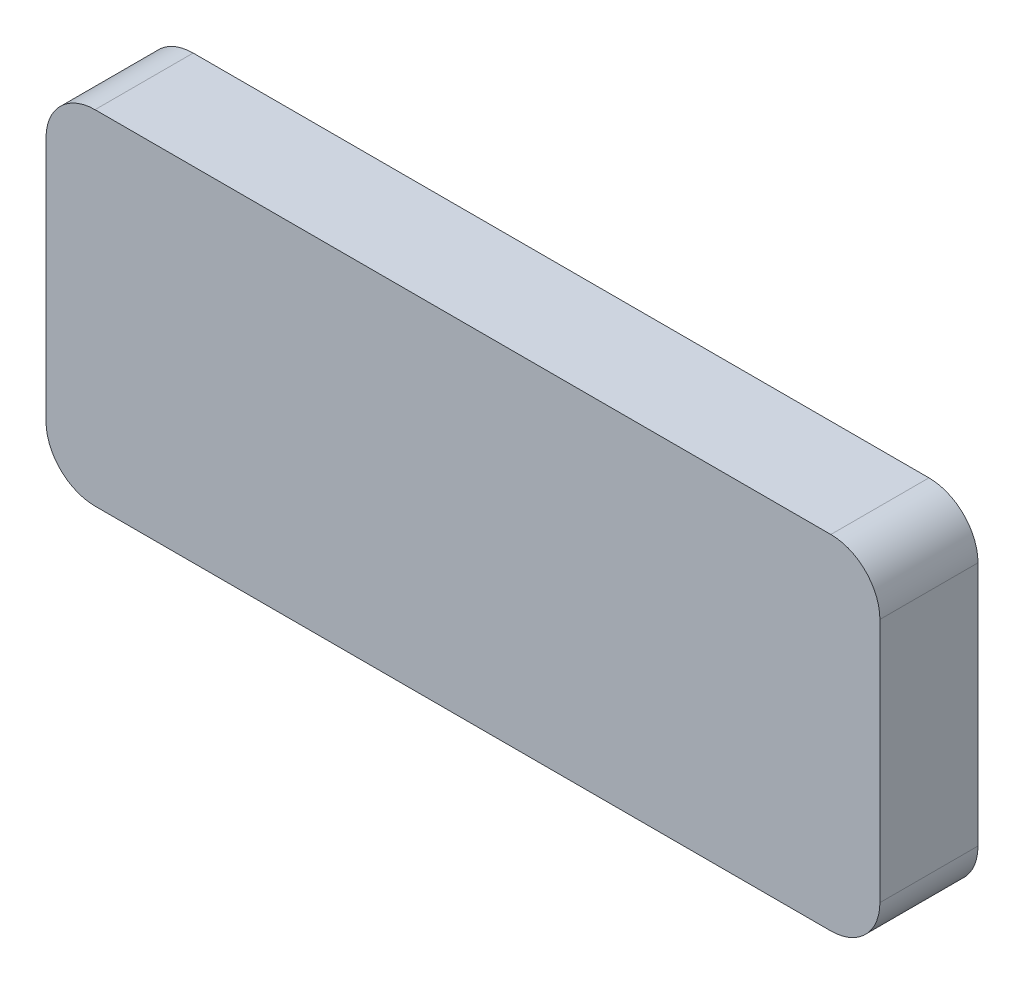
ISO-10303-21;
HEADER;
FILE_DESCRIPTION(('STEP AP214'),'2;1');
FILE_NAME('part.step','',(''),(''),'','','');
FILE_SCHEMA(('AUTOMOTIVE_DESIGN { 1 0 10303 214 1 1 1 1 }'));
ENDSEC;
DATA;
#1=APPLICATION_CONTEXT('core data for automotive mechanical design processes');
#2=APPLICATION_PROTOCOL_DEFINITION('international standard','automotive_design',2000,#1);
#3=PRODUCT_CONTEXT('',#1,'mechanical');
#4=PRODUCT('Part','Part','',(#3));
#5=PRODUCT_RELATED_PRODUCT_CATEGORY('part','',(#4));
#6=PRODUCT_DEFINITION_FORMATION('','',#4);
#7=PRODUCT_DEFINITION_CONTEXT('part definition',#1,'design');
#8=PRODUCT_DEFINITION('design','',#6,#7);
#9=PRODUCT_DEFINITION_SHAPE('','',#8);
#10=(LENGTH_UNIT() NAMED_UNIT(*) SI_UNIT(.MILLI.,.METRE.));
#11=(NAMED_UNIT(*) PLANE_ANGLE_UNIT() SI_UNIT($,.RADIAN.));
#12=(NAMED_UNIT(*) SI_UNIT($,.STERADIAN.) SOLID_ANGLE_UNIT());
#13=UNCERTAINTY_MEASURE_WITH_UNIT(LENGTH_MEASURE(1.E-05),#10,'distance_accuracy_value','');
#14=(GEOMETRIC_REPRESENTATION_CONTEXT(3) GLOBAL_UNCERTAINTY_ASSIGNED_CONTEXT((#13)) GLOBAL_UNIT_ASSIGNED_CONTEXT((#10,
#11,#12)) REPRESENTATION_CONTEXT('',''));
#15=CARTESIAN_POINT('',(0.,0.,0.));
#16=DIRECTION('',(0.,0.,1.));
#17=DIRECTION('',(1.,0.,0.));
#18=AXIS2_PLACEMENT_3D('',#15,#16,#17);
#19=CARTESIAN_POINT('',(-8.5,-3.5,2.));
#20=DIRECTION('',(1.,0.,0.));
#21=DIRECTION('',(0.,0.,-1.));
#22=AXIS2_PLACEMENT_3D('',#19,#20,#21);
#23=PLANE('',#22);
#24=DIRECTION('',(0.,-1.,0.));
#25=VECTOR('',#24,1.);
#26=CARTESIAN_POINT('',(-8.5,-3.5,0.));
#27=LINE('',#26,#25);
#28=CARTESIAN_POINT('',(-8.5,2.5,0.));
#29=VERTEX_POINT('',#28);
#30=CARTESIAN_POINT('',(-8.5,-2.5,0.));
#31=VERTEX_POINT('',#30);
#32=EDGE_CURVE('E126',#29,#31,#27,.T.);
#33=ORIENTED_EDGE('',*,*,#32,.T.);
#34=DIRECTION('',(0.,0.,-1.));
#35=VECTOR('',#34,1.);
#36=CARTESIAN_POINT('',(-8.5,-2.5,2.));
#37=LINE('',#36,#35);
#38=CARTESIAN_POINT('',(-8.5,-2.5,2.));
#39=VERTEX_POINT('',#38);
#40=EDGE_CURVE('E104',#31,#39,#37,.F.);
#41=ORIENTED_EDGE('',*,*,#40,.T.);
#42=DIRECTION('',(0.,-1.,0.));
#43=VECTOR('',#42,1.);
#44=CARTESIAN_POINT('',(-8.5,-3.5,2.));
#45=LINE('',#44,#43);
#46=CARTESIAN_POINT('',(-8.5,2.5,2.));
#47=VERTEX_POINT('',#46);
#48=EDGE_CURVE('E135',#47,#39,#45,.T.);
#49=ORIENTED_EDGE('',*,*,#48,.F.);
#50=DIRECTION('',(0.,0.,-1.));
#51=VECTOR('',#50,1.);
#52=CARTESIAN_POINT('',(-8.5,2.5,2.));
#53=LINE('',#52,#51);
#54=EDGE_CURVE('E109',#47,#29,#53,.T.);
#55=ORIENTED_EDGE('',*,*,#54,.T.);
#56=EDGE_LOOP('',(#33,#41,#49,#55));
#57=FACE_BOUND('',#56,.T.);
#58=ADVANCED_FACE('F33',(#57),#23,.F.);
#59=CARTESIAN_POINT('',(8.5,-3.5,2.));
#60=DIRECTION('',(0.,1.,0.));
#61=DIRECTION('',(-1.,0.,0.));
#62=AXIS2_PLACEMENT_3D('',#59,#60,#61);
#63=PLANE('',#62);
#64=DIRECTION('',(1.,0.,0.));
#65=VECTOR('',#64,1.);
#66=CARTESIAN_POINT('',(8.5,-3.5,2.));
#67=LINE('',#66,#65);
#68=CARTESIAN_POINT('',(-7.5,-3.5,2.));
#69=VERTEX_POINT('',#68);
#70=CARTESIAN_POINT('',(7.5,-3.5,2.));
#71=VERTEX_POINT('',#70);
#72=EDGE_CURVE('E119',#69,#71,#67,.T.);
#73=ORIENTED_EDGE('',*,*,#72,.F.);
#74=DIRECTION('',(0.,0.,-1.));
#75=VECTOR('',#74,1.);
#76=CARTESIAN_POINT('',(-7.5,-3.5,2.));
#77=LINE('',#76,#75);
#78=CARTESIAN_POINT('',(-7.5,-3.5,0.));
#79=VERTEX_POINT('',#78);
#80=EDGE_CURVE('E103',#69,#79,#77,.T.);
#81=ORIENTED_EDGE('',*,*,#80,.T.);
#82=DIRECTION('',(1.,0.,0.));
#83=VECTOR('',#82,1.);
#84=CARTESIAN_POINT('',(8.5,-3.5,0.));
#85=LINE('',#84,#83);
#86=CARTESIAN_POINT('',(7.5,-3.5,0.));
#87=VERTEX_POINT('',#86);
#88=EDGE_CURVE('E116',#79,#87,#85,.T.);
#89=ORIENTED_EDGE('',*,*,#88,.T.);
#90=DIRECTION('',(0.,0.,-1.));
#91=VECTOR('',#90,1.);
#92=CARTESIAN_POINT('',(7.5,-3.5,2.));
#93=LINE('',#92,#91);
#94=EDGE_CURVE('E121',#87,#71,#93,.F.);
#95=ORIENTED_EDGE('',*,*,#94,.T.);
#96=EDGE_LOOP('',(#73,#81,#89,#95));
#97=FACE_BOUND('',#96,.T.);
#98=ADVANCED_FACE('F115',(#97),#63,.F.);
#99=CARTESIAN_POINT('',(8.5,-3.5,2.));
#100=DIRECTION('',(-1.,0.,0.));
#101=DIRECTION('',(0.,0.,1.));
#102=AXIS2_PLACEMENT_3D('',#99,#100,#101);
#103=PLANE('',#102);
#104=DIRECTION('',(0.,1.,0.));
#105=VECTOR('',#104,1.);
#106=CARTESIAN_POINT('',(8.5,-3.5,2.));
#107=LINE('',#106,#105);
#108=CARTESIAN_POINT('',(8.5,-2.5,2.));
#109=VERTEX_POINT('',#108);
#110=CARTESIAN_POINT('',(8.5,2.5,2.));
#111=VERTEX_POINT('',#110);
#112=EDGE_CURVE('E161',#109,#111,#107,.T.);
#113=ORIENTED_EDGE('',*,*,#112,.F.);
#114=DIRECTION('',(0.,0.,-1.));
#115=VECTOR('',#114,1.);
#116=CARTESIAN_POINT('',(8.5,-2.5,2.));
#117=LINE('',#116,#115);
#118=CARTESIAN_POINT('',(8.5,-2.5,0.));
#119=VERTEX_POINT('',#118);
#120=EDGE_CURVE('E154',#109,#119,#117,.T.);
#121=ORIENTED_EDGE('',*,*,#120,.T.);
#122=DIRECTION('',(0.,1.,0.));
#123=VECTOR('',#122,1.);
#124=CARTESIAN_POINT('',(8.5,-3.5,0.));
#125=LINE('',#124,#123);
#126=CARTESIAN_POINT('',(8.5,2.5,0.));
#127=VERTEX_POINT('',#126);
#128=EDGE_CURVE('E125',#119,#127,#125,.T.);
#129=ORIENTED_EDGE('',*,*,#128,.T.);
#130=DIRECTION('',(0.,0.,-1.));
#131=VECTOR('',#130,1.);
#132=CARTESIAN_POINT('',(8.5,2.5,2.));
#133=LINE('',#132,#131);
#134=EDGE_CURVE('E152',#127,#111,#133,.F.);
#135=ORIENTED_EDGE('',*,*,#134,.T.);
#136=EDGE_LOOP('',(#113,#121,#129,#135));
#137=FACE_BOUND('',#136,.T.);
#138=ADVANCED_FACE('F159',(#137),#103,.F.);
#139=CARTESIAN_POINT('',(8.5,3.5,2.));
#140=DIRECTION('',(0.,-1.,0.));
#141=DIRECTION('',(1.,0.,0.));
#142=AXIS2_PLACEMENT_3D('',#139,#140,#141);
#143=PLANE('',#142);
#144=DIRECTION('',(-1.,0.,0.));
#145=VECTOR('',#144,1.);
#146=CARTESIAN_POINT('',(8.5,3.5,2.));
#147=LINE('',#146,#145);
#148=CARTESIAN_POINT('',(7.5,3.5,2.));
#149=VERTEX_POINT('',#148);
#150=CARTESIAN_POINT('',(-7.5,3.5,2.));
#151=VERTEX_POINT('',#150);
#152=EDGE_CURVE('E136',#149,#151,#147,.T.);
#153=ORIENTED_EDGE('',*,*,#152,.F.);
#154=DIRECTION('',(0.,0.,-1.));
#155=VECTOR('',#154,1.);
#156=CARTESIAN_POINT('',(7.5,3.5,2.));
#157=LINE('',#156,#155);
#158=CARTESIAN_POINT('',(7.5,3.5,0.));
#159=VERTEX_POINT('',#158);
#160=EDGE_CURVE('E11',#149,#159,#157,.T.);
#161=ORIENTED_EDGE('',*,*,#160,.T.);
#162=DIRECTION('',(-1.,0.,0.));
#163=VECTOR('',#162,1.);
#164=CARTESIAN_POINT('',(8.5,3.5,0.));
#165=LINE('',#164,#163);
#166=CARTESIAN_POINT('',(-7.5,3.5,0.));
#167=VERTEX_POINT('',#166);
#168=EDGE_CURVE('E129',#159,#167,#165,.T.);
#169=ORIENTED_EDGE('',*,*,#168,.T.);
#170=DIRECTION('',(0.,0.,-1.));
#171=VECTOR('',#170,1.);
#172=CARTESIAN_POINT('',(-7.5,3.5,2.));
#173=LINE('',#172,#171);
#174=EDGE_CURVE('E41',#167,#151,#173,.F.);
#175=ORIENTED_EDGE('',*,*,#174,.T.);
#176=EDGE_LOOP('',(#153,#161,#169,#175));
#177=FACE_BOUND('',#176,.T.);
#178=ADVANCED_FACE('F168',(#177),#143,.F.);
#179=CARTESIAN_POINT('',(0.,0.,2.));
#180=DIRECTION('',(0.,0.,1.));
#181=DIRECTION('',(1.,0.,0.));
#182=AXIS2_PLACEMENT_3D('',#179,#180,#181);
#183=PLANE('',#182);
#184=ORIENTED_EDGE('',*,*,#48,.T.);
#185=CARTESIAN_POINT('',(-7.5,-2.5,2.));
#186=DIRECTION('',(0.,0.,1.));
#187=DIRECTION('',(1.,0.,0.));
#188=AXIS2_PLACEMENT_3D('',#185,#186,#187);
#189=CIRCLE('',#188,1.);
#190=EDGE_CURVE('E150',#39,#69,#189,.T.);
#191=ORIENTED_EDGE('',*,*,#190,.T.);
#192=ORIENTED_EDGE('',*,*,#72,.T.);
#193=CARTESIAN_POINT('',(7.5,-2.5,2.));
#194=DIRECTION('',(0.,0.,1.));
#195=DIRECTION('',(1.,0.,0.));
#196=AXIS2_PLACEMENT_3D('',#193,#194,#195);
#197=CIRCLE('',#196,1.);
#198=EDGE_CURVE('E148',#71,#109,#197,.T.);
#199=ORIENTED_EDGE('',*,*,#198,.T.);
#200=ORIENTED_EDGE('',*,*,#112,.T.);
#201=CARTESIAN_POINT('',(7.5,2.5,2.));
#202=DIRECTION('',(0.,0.,1.));
#203=DIRECTION('',(1.,0.,0.));
#204=AXIS2_PLACEMENT_3D('',#201,#202,#203);
#205=CIRCLE('',#204,1.);
#206=EDGE_CURVE('E54',#111,#149,#205,.T.);
#207=ORIENTED_EDGE('',*,*,#206,.T.);
#208=ORIENTED_EDGE('',*,*,#152,.T.);
#209=CARTESIAN_POINT('',(-7.5,2.5,2.));
#210=DIRECTION('',(0.,0.,1.));
#211=DIRECTION('',(1.,0.,0.));
#212=AXIS2_PLACEMENT_3D('',#209,#210,#211);
#213=CIRCLE('',#212,1.);
#214=EDGE_CURVE('E145',#151,#47,#213,.T.);
#215=ORIENTED_EDGE('',*,*,#214,.T.);
#216=EDGE_LOOP('',(#184,#191,#192,#199,#200,#207,#208,#215));
#217=FACE_BOUND('',#216,.T.);
#218=ADVANCED_FACE('F175',(#217),#183,.T.);
#219=CARTESIAN_POINT('',(0.,0.,0.));
#220=DIRECTION('',(0.,0.,1.));
#221=DIRECTION('',(1.,0.,0.));
#222=AXIS2_PLACEMENT_3D('',#219,#220,#221);
#223=PLANE('',#222);
#224=ORIENTED_EDGE('',*,*,#88,.F.);
#225=CARTESIAN_POINT('',(-7.5,-2.5,0.));
#226=DIRECTION('',(0.,0.,1.));
#227=DIRECTION('',(1.,0.,0.));
#228=AXIS2_PLACEMENT_3D('',#225,#226,#227);
#229=CIRCLE('',#228,1.);
#230=EDGE_CURVE('E99',#79,#31,#229,.F.);
#231=ORIENTED_EDGE('',*,*,#230,.T.);
#232=ORIENTED_EDGE('',*,*,#32,.F.);
#233=CARTESIAN_POINT('',(-7.5,2.5,0.));
#234=DIRECTION('',(0.,0.,1.));
#235=DIRECTION('',(1.,0.,0.));
#236=AXIS2_PLACEMENT_3D('',#233,#234,#235);
#237=CIRCLE('',#236,1.);
#238=EDGE_CURVE('E120',#29,#167,#237,.F.);
#239=ORIENTED_EDGE('',*,*,#238,.T.);
#240=ORIENTED_EDGE('',*,*,#168,.F.);
#241=CARTESIAN_POINT('',(7.5,2.5,0.));
#242=DIRECTION('',(0.,0.,1.));
#243=DIRECTION('',(1.,0.,0.));
#244=AXIS2_PLACEMENT_3D('',#241,#242,#243);
#245=CIRCLE('',#244,1.);
#246=EDGE_CURVE('E139',#159,#127,#245,.F.);
#247=ORIENTED_EDGE('',*,*,#246,.T.);
#248=ORIENTED_EDGE('',*,*,#128,.F.);
#249=CARTESIAN_POINT('',(7.5,-2.5,0.));
#250=DIRECTION('',(0.,0.,1.));
#251=DIRECTION('',(1.,0.,0.));
#252=AXIS2_PLACEMENT_3D('',#249,#250,#251);
#253=CIRCLE('',#252,1.);
#254=EDGE_CURVE('E110',#119,#87,#253,.F.);
#255=ORIENTED_EDGE('',*,*,#254,.T.);
#256=EDGE_LOOP('',(#224,#231,#232,#239,#240,#247,#248,#255));
#257=FACE_BOUND('',#256,.T.);
#258=ADVANCED_FACE('F123',(#257),#223,.F.);
#259=CARTESIAN_POINT('',(-7.5,-2.5,2.));
#260=DIRECTION('',(0.,0.,-1.));
#261=DIRECTION('',(-1.,0.,0.));
#262=AXIS2_PLACEMENT_3D('',#259,#260,#261);
#263=CYLINDRICAL_SURFACE('',#262,1.);
#264=ORIENTED_EDGE('',*,*,#190,.F.);
#265=ORIENTED_EDGE('',*,*,#40,.F.);
#266=ORIENTED_EDGE('',*,*,#230,.F.);
#267=ORIENTED_EDGE('',*,*,#80,.F.);
#268=EDGE_LOOP('',(#264,#265,#266,#267));
#269=FACE_BOUND('',#268,.T.);
#270=ADVANCED_FACE('F102',(#269),#263,.T.);
#271=CARTESIAN_POINT('',(7.5,-2.5,2.));
#272=DIRECTION('',(0.,0.,-1.));
#273=DIRECTION('',(-1.,0.,0.));
#274=AXIS2_PLACEMENT_3D('',#271,#272,#273);
#275=CYLINDRICAL_SURFACE('',#274,1.);
#276=ORIENTED_EDGE('',*,*,#198,.F.);
#277=ORIENTED_EDGE('',*,*,#94,.F.);
#278=ORIENTED_EDGE('',*,*,#254,.F.);
#279=ORIENTED_EDGE('',*,*,#120,.F.);
#280=EDGE_LOOP('',(#276,#277,#278,#279));
#281=FACE_BOUND('',#280,.T.);
#282=ADVANCED_FACE('F183',(#281),#275,.T.);
#283=CARTESIAN_POINT('',(7.5,2.5,2.));
#284=DIRECTION('',(0.,0.,-1.));
#285=DIRECTION('',(-1.,0.,0.));
#286=AXIS2_PLACEMENT_3D('',#283,#284,#285);
#287=CYLINDRICAL_SURFACE('',#286,1.);
#288=ORIENTED_EDGE('',*,*,#206,.F.);
#289=ORIENTED_EDGE('',*,*,#134,.F.);
#290=ORIENTED_EDGE('',*,*,#246,.F.);
#291=ORIENTED_EDGE('',*,*,#160,.F.);
#292=EDGE_LOOP('',(#288,#289,#290,#291));
#293=FACE_BOUND('',#292,.T.);
#294=ADVANCED_FACE('F167',(#293),#287,.T.);
#295=CARTESIAN_POINT('',(-7.5,2.5,2.));
#296=DIRECTION('',(0.,0.,-1.));
#297=DIRECTION('',(-1.,0.,0.));
#298=AXIS2_PLACEMENT_3D('',#295,#296,#297);
#299=CYLINDRICAL_SURFACE('',#298,1.);
#300=ORIENTED_EDGE('',*,*,#214,.F.);
#301=ORIENTED_EDGE('',*,*,#174,.F.);
#302=ORIENTED_EDGE('',*,*,#238,.F.);
#303=ORIENTED_EDGE('',*,*,#54,.F.);
#304=EDGE_LOOP('',(#300,#301,#302,#303));
#305=FACE_BOUND('',#304,.T.);
#306=ADVANCED_FACE('F35',(#305),#299,.T.);
#307=CLOSED_SHELL('',(#58,#98,#138,#178,#218,#258,#270,#282,#294,#306));
#308=MANIFOLD_SOLID_BREP('B2',#307);
#309=ADVANCED_BREP_SHAPE_REPRESENTATION('',(#18,#308),#14);
#310=SHAPE_DEFINITION_REPRESENTATION(#9,#309);
ENDSEC;
END-ISO-10303-21;
